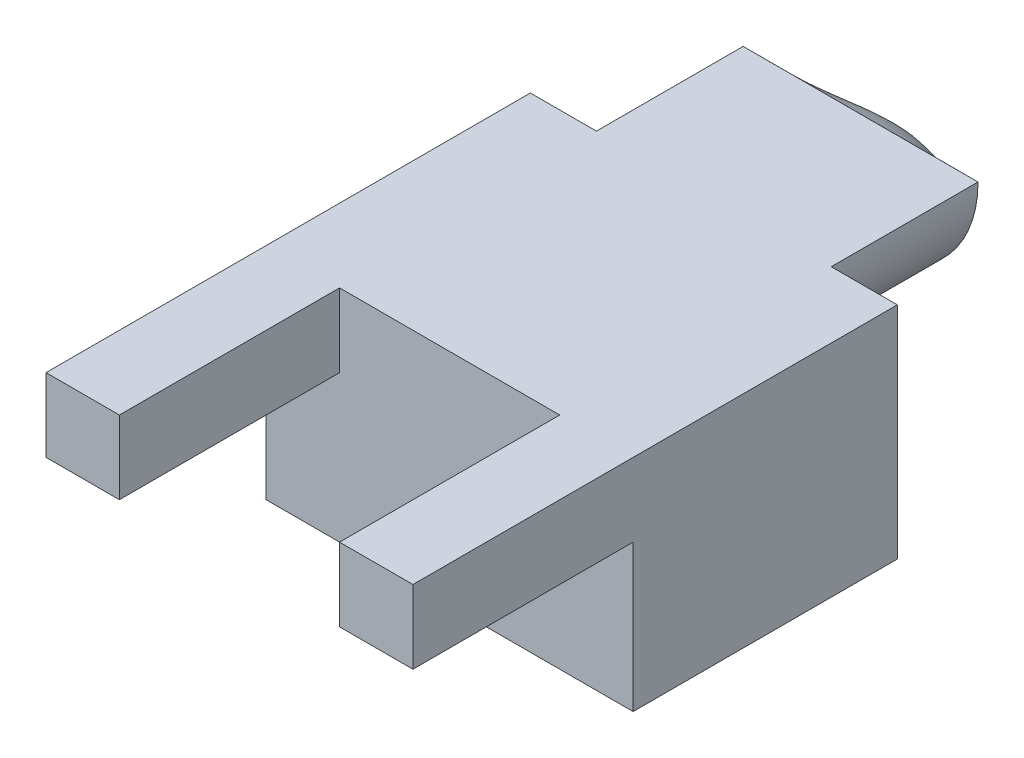
ISO-10303-21;
HEADER;
FILE_DESCRIPTION(('STEP AP214'),'2;1');
FILE_NAME('part.step','',(''),(''),'','','');
FILE_SCHEMA(('AUTOMOTIVE_DESIGN { 1 0 10303 214 1 1 1 1 }'));
ENDSEC;
DATA;
#1=APPLICATION_CONTEXT('core data for automotive mechanical design processes');
#2=APPLICATION_PROTOCOL_DEFINITION('international standard','automotive_design',2000,#1);
#3=PRODUCT_CONTEXT('',#1,'mechanical');
#4=PRODUCT('Part','Part','',(#3));
#5=PRODUCT_RELATED_PRODUCT_CATEGORY('part','',(#4));
#6=PRODUCT_DEFINITION_FORMATION('','',#4);
#7=PRODUCT_DEFINITION_CONTEXT('part definition',#1,'design');
#8=PRODUCT_DEFINITION('design','',#6,#7);
#9=PRODUCT_DEFINITION_SHAPE('','',#8);
#10=(LENGTH_UNIT() NAMED_UNIT(*) SI_UNIT(.MILLI.,.METRE.));
#11=(NAMED_UNIT(*) PLANE_ANGLE_UNIT() SI_UNIT($,.RADIAN.));
#12=(NAMED_UNIT(*) SI_UNIT($,.STERADIAN.) SOLID_ANGLE_UNIT());
#13=UNCERTAINTY_MEASURE_WITH_UNIT(LENGTH_MEASURE(1.E-05),#10,'distance_accuracy_value','');
#14=(GEOMETRIC_REPRESENTATION_CONTEXT(3) GLOBAL_UNCERTAINTY_ASSIGNED_CONTEXT((#13)) GLOBAL_UNIT_ASSIGNED_CONTEXT((#10,
#11,#12)) REPRESENTATION_CONTEXT('',''));
#15=CARTESIAN_POINT('',(0.,0.,0.));
#16=DIRECTION('',(0.,0.,1.));
#17=DIRECTION('',(1.,0.,0.));
#18=AXIS2_PLACEMENT_3D('',#15,#16,#17);
#19=CARTESIAN_POINT('',(0.,0.,0.));
#20=DIRECTION('',(0.,0.,-1.));
#21=DIRECTION('',(-1.,0.,0.));
#22=AXIS2_PLACEMENT_3D('',#19,#20,#21);
#23=PLANE('',#22);
#24=DIRECTION('',(0.,-1.,0.));
#25=VECTOR('',#24,1.);
#26=CARTESIAN_POINT('',(5.08,3.81,0.));
#27=LINE('',#26,#25);
#28=CARTESIAN_POINT('',(5.08,3.81,0.));
#29=VERTEX_POINT('',#28);
#30=CARTESIAN_POINT('',(5.08,2.54,0.));
#31=VERTEX_POINT('',#30);
#32=EDGE_CURVE('E182',#29,#31,#27,.T.);
#33=ORIENTED_EDGE('',*,*,#32,.F.);
#34=DIRECTION('',(-1.,0.,0.));
#35=VECTOR('',#34,1.);
#36=CARTESIAN_POINT('',(0.,3.81,0.));
#37=LINE('',#36,#35);
#38=CARTESIAN_POINT('',(1.27,3.81,0.));
#39=VERTEX_POINT('',#38);
#40=EDGE_CURVE('E184',#29,#39,#37,.T.);
#41=ORIENTED_EDGE('',*,*,#40,.T.);
#42=DIRECTION('',(0.,1.,0.));
#43=VECTOR('',#42,1.);
#44=CARTESIAN_POINT('',(1.27,3.81,0.));
#45=LINE('',#44,#43);
#46=CARTESIAN_POINT('',(1.27,2.54,0.));
#47=VERTEX_POINT('',#46);
#48=EDGE_CURVE('E212',#47,#39,#45,.T.);
#49=ORIENTED_EDGE('',*,*,#48,.F.);
#50=DIRECTION('',(1.,0.,0.));
#51=VECTOR('',#50,1.);
#52=CARTESIAN_POINT('',(0.,2.54,0.));
#53=LINE('',#52,#51);
#54=CARTESIAN_POINT('',(0.,2.54,0.));
#55=VERTEX_POINT('',#54);
#56=EDGE_CURVE('E208',#55,#47,#53,.T.);
#57=ORIENTED_EDGE('',*,*,#56,.F.);
#58=DIRECTION('',(0.,-1.,0.));
#59=VECTOR('',#58,1.);
#60=CARTESIAN_POINT('',(0.,0.,0.));
#61=LINE('',#60,#59);
#62=CARTESIAN_POINT('',(0.,0.,0.));
#63=VERTEX_POINT('',#62);
#64=EDGE_CURVE('E254',#55,#63,#61,.T.);
#65=ORIENTED_EDGE('',*,*,#64,.T.);
#66=DIRECTION('',(1.,0.,0.));
#67=VECTOR('',#66,1.);
#68=CARTESIAN_POINT('',(0.,0.,0.));
#69=LINE('',#68,#67);
#70=CARTESIAN_POINT('',(6.35,0.,0.));
#71=VERTEX_POINT('',#70);
#72=EDGE_CURVE('E256',#63,#71,#69,.T.);
#73=ORIENTED_EDGE('',*,*,#72,.T.);
#74=DIRECTION('',(0.,1.,0.));
#75=VECTOR('',#74,1.);
#76=CARTESIAN_POINT('',(6.35,0.,0.));
#77=LINE('',#76,#75);
#78=CARTESIAN_POINT('',(6.35,2.54,0.));
#79=VERTEX_POINT('',#78);
#80=EDGE_CURVE('E204',#71,#79,#77,.T.);
#81=ORIENTED_EDGE('',*,*,#80,.T.);
#82=DIRECTION('',(1.,0.,0.));
#83=VECTOR('',#82,1.);
#84=CARTESIAN_POINT('',(6.35,2.54,0.));
#85=LINE('',#84,#83);
#86=EDGE_CURVE('E187',#31,#79,#85,.T.);
#87=ORIENTED_EDGE('',*,*,#86,.F.);
#88=EDGE_LOOP('',(#33,#41,#49,#57,#65,#73,#81,#87));
#89=FACE_BOUND('',#88,.T.);
#90=ADVANCED_FACE('F83',(#89),#23,.F.);
#91=CARTESIAN_POINT('',(0.,0.,-4.572));
#92=DIRECTION('',(-1.,0.,0.));
#93=DIRECTION('',(0.,0.,1.));
#94=AXIS2_PLACEMENT_3D('',#91,#92,#93);
#95=PLANE('',#94);
#96=ORIENTED_EDGE('',*,*,#64,.F.);
#97=DIRECTION('',(0.,0.,-1.));
#98=VECTOR('',#97,1.);
#99=CARTESIAN_POINT('',(0.,2.54,3.81));
#100=LINE('',#99,#98);
#101=CARTESIAN_POINT('',(0.,2.54,3.81));
#102=VERTEX_POINT('',#101);
#103=EDGE_CURVE('E257',#102,#55,#100,.T.);
#104=ORIENTED_EDGE('',*,*,#103,.F.);
#105=DIRECTION('',(0.,-1.,0.));
#106=VECTOR('',#105,1.);
#107=CARTESIAN_POINT('',(0.,3.81,3.81));
#108=LINE('',#107,#106);
#109=CARTESIAN_POINT('',(0.,3.81,3.81));
#110=VERTEX_POINT('',#109);
#111=EDGE_CURVE('E218',#110,#102,#108,.T.);
#112=ORIENTED_EDGE('',*,*,#111,.F.);
#113=DIRECTION('',(0.,0.,1.));
#114=VECTOR('',#113,1.);
#115=CARTESIAN_POINT('',(0.,3.81,-4.572));
#116=LINE('',#115,#114);
#117=CARTESIAN_POINT('',(0.,3.81,-4.572));
#118=VERTEX_POINT('',#117);
#119=EDGE_CURVE('E13',#118,#110,#116,.T.);
#120=ORIENTED_EDGE('',*,*,#119,.F.);
#121=DIRECTION('',(0.,-1.,0.));
#122=VECTOR('',#121,1.);
#123=CARTESIAN_POINT('',(0.,0.,-4.572));
#124=LINE('',#123,#122);
#125=CARTESIAN_POINT('',(0.,0.,-4.572));
#126=VERTEX_POINT('',#125);
#127=EDGE_CURVE('E203',#118,#126,#124,.T.);
#128=ORIENTED_EDGE('',*,*,#127,.T.);
#129=DIRECTION('',(0.,0.,1.));
#130=VECTOR('',#129,1.);
#131=CARTESIAN_POINT('',(0.,0.,-4.572));
#132=LINE('',#131,#130);
#133=EDGE_CURVE('E251',#126,#63,#132,.T.);
#134=ORIENTED_EDGE('',*,*,#133,.T.);
#135=EDGE_LOOP('',(#96,#104,#112,#120,#128,#134));
#136=FACE_BOUND('',#135,.T.);
#137=ADVANCED_FACE('F329',(#136),#95,.T.);
#138=CARTESIAN_POINT('',(0.,3.81,-4.572));
#139=DIRECTION('',(0.,1.,0.));
#140=DIRECTION('',(0.,0.,1.));
#141=AXIS2_PLACEMENT_3D('',#138,#139,#140);
#142=PLANE('',#141);
#143=ORIENTED_EDGE('',*,*,#40,.F.);
#144=DIRECTION('',(0.,0.,-1.));
#145=VECTOR('',#144,1.);
#146=CARTESIAN_POINT('',(5.08,3.81,3.81));
#147=LINE('',#146,#145);
#148=CARTESIAN_POINT('',(5.08,3.81,3.81));
#149=VERTEX_POINT('',#148);
#150=EDGE_CURVE('E198',#149,#29,#147,.T.);
#151=ORIENTED_EDGE('',*,*,#150,.F.);
#152=DIRECTION('',(-1.,0.,0.));
#153=VECTOR('',#152,1.);
#154=CARTESIAN_POINT('',(6.35,3.81,3.81));
#155=LINE('',#154,#153);
#156=CARTESIAN_POINT('',(6.35,3.81,3.81));
#157=VERTEX_POINT('',#156);
#158=EDGE_CURVE('E280',#157,#149,#155,.T.);
#159=ORIENTED_EDGE('',*,*,#158,.F.);
#160=DIRECTION('',(0.,0.,1.));
#161=VECTOR('',#160,1.);
#162=CARTESIAN_POINT('',(6.35,3.81,-4.572));
#163=LINE('',#162,#161);
#164=CARTESIAN_POINT('',(6.35,3.81,-4.572));
#165=VERTEX_POINT('',#164);
#166=EDGE_CURVE('E100',#165,#157,#163,.T.);
#167=ORIENTED_EDGE('',*,*,#166,.F.);
#168=DIRECTION('',(-1.,0.,0.));
#169=VECTOR('',#168,1.);
#170=CARTESIAN_POINT('',(0.,3.81,-4.572));
#171=LINE('',#170,#169);
#172=CARTESIAN_POINT('',(5.207,3.81,-4.572));
#173=VERTEX_POINT('',#172);
#174=EDGE_CURVE('E241',#165,#173,#171,.T.);
#175=ORIENTED_EDGE('',*,*,#174,.T.);
#176=DIRECTION('',(0.,0.,1.));
#177=VECTOR('',#176,1.);
#178=CARTESIAN_POINT('',(5.207,3.81,-7.112));
#179=LINE('',#178,#177);
#180=CARTESIAN_POINT('',(5.20699972167354,3.81,-7.11143206771134));
#181=VERTEX_POINT('',#180);
#182=EDGE_CURVE('E290',#181,#173,#179,.T.);
#183=ORIENTED_EDGE('',*,*,#182,.F.);
#184=CARTESIAN_POINT('',(1.14300050463616,3.80999999999999,-7.11144132057572));
#185=CARTESIAN_POINT('',(1.2320306513021,3.81,-7.11186431632875));
#186=CARTESIAN_POINT('',(1.32106113587505,3.81,-7.11205391509631));
#187=CARTESIAN_POINT('',(1.49912232090601,3.81,-7.11220393854591));
#188=CARTESIAN_POINT('',(1.58815302136378,3.81,-7.11216436343169));
#189=CARTESIAN_POINT('',(1.76621429760909,3.81,-7.1120936589257));
#190=CARTESIAN_POINT('',(1.85524487339669,3.81,-7.11206252953025));
#191=CARTESIAN_POINT('',(2.0333060686502,3.81,-7.11204854654176));
#192=CARTESIAN_POINT('',(2.12233668811612,3.81,-7.11206569295735));
#193=CARTESIAN_POINT('',(2.36982375119607,3.81,-7.11212380894754));
#194=CARTESIAN_POINT('',(2.52828018538376,3.81,-7.11217292929915));
#195=CARTESIAN_POINT('',(2.84519305758697,3.81,-7.11223651561029));
#196=CARTESIAN_POINT('',(3.00364949560249,3.81,-7.11225098157197));
#197=CARTESIAN_POINT('',(3.32056236841674,3.81,-7.11224750999009));
#198=CARTESIAN_POINT('',(3.47901880321548,3.81,-7.11222957244675));
#199=CARTESIAN_POINT('',(3.79593167834449,3.81,-7.11217743236209));
#200=CARTESIAN_POINT('',(3.95438811867475,3.81000000000001,-7.11214322981965));
#201=CARTESIAN_POINT('',(4.20402417912265,3.81000000000001,-7.11207455399221));
#202=CARTESIAN_POINT('',(4.29520379756178,3.81,-7.11204636117595));
#203=CARTESIAN_POINT('',(4.477563016709,3.81,-7.11204862306896));
#204=CARTESIAN_POINT('',(4.5687426174171,3.81,-7.11207907776872));
#205=CARTESIAN_POINT('',(4.75110187243864,3.81,-7.11215472487758));
#206=CARTESIAN_POINT('',(4.84228152675207,3.81,-7.11219991729496));
#207=CARTESIAN_POINT('',(4.97905102198201,3.81,-7.11211361150889));
#208=CARTESIAN_POINT('',(5.02464085972267,3.81,-7.11205916050082));
#209=CARTESIAN_POINT('',(5.11582037390659,3.81,-7.11184151422171));
#210=CARTESIAN_POINT('',(5.16141005034909,3.81,-7.11167831866184));
#211=CARTESIAN_POINT('',(5.20699944334705,3.81,-7.11143206102018));
#212=B_SPLINE_CURVE_WITH_KNOTS('',3,(#184,#185,#186,#187,#188,#189,#190,#191,#192,#193,#194,
#195,#196,#197,#198,#199,#200,#201,#202,#203,#204,#205,#206,#207,#208,#209,#210,#211),
.UNSPECIFIED.,.F.,.F.,(4,2,2,2,2,2,2,2,2,2,2,2,2,4),(0.,0.2670921484212,0.534184059403624,
0.801275853628482,1.0683676956029,1.54373703347932,2.01910634166462,2.4944756467027,
2.96984498419257,3.24338384217931,3.51692265579364,3.79046162294121,3.92723112873933,
4.06400099779846),.UNSPECIFIED.);
#213=CARTESIAN_POINT('',(1.14300025231807,3.81,-7.11144132692253));
#214=VERTEX_POINT('',#213);
#215=EDGE_CURVE('E90',#214,#181,#212,.T.);
#216=ORIENTED_EDGE('',*,*,#215,.F.);
#217=DIRECTION('',(0.,0.,1.));
#218=VECTOR('',#217,1.);
#219=CARTESIAN_POINT('',(1.143,3.81,-7.112));
#220=LINE('',#219,#218);
#221=CARTESIAN_POINT('',(1.143,3.81,-4.572));
#222=VERTEX_POINT('',#221);
#223=EDGE_CURVE('E192',#214,#222,#220,.T.);
#224=ORIENTED_EDGE('',*,*,#223,.T.);
#225=EDGE_CURVE('E127',#222,#118,#171,.T.);
#226=ORIENTED_EDGE('',*,*,#225,.T.);
#227=ORIENTED_EDGE('',*,*,#119,.T.);
#228=DIRECTION('',(-1.,0.,0.));
#229=VECTOR('',#228,1.);
#230=CARTESIAN_POINT('',(0.,3.81,3.81));
#231=LINE('',#230,#229);
#232=CARTESIAN_POINT('',(1.27,3.81,3.81));
#233=VERTEX_POINT('',#232);
#234=EDGE_CURVE('E225',#233,#110,#231,.T.);
#235=ORIENTED_EDGE('',*,*,#234,.F.);
#236=DIRECTION('',(0.,0.,-1.));
#237=VECTOR('',#236,1.);
#238=CARTESIAN_POINT('',(1.27,3.81,3.81));
#239=LINE('',#238,#237);
#240=EDGE_CURVE('E202',#233,#39,#239,.T.);
#241=ORIENTED_EDGE('',*,*,#240,.T.);
#242=EDGE_LOOP('',(#143,#151,#159,#167,#175,#183,#216,#224,#226,#227,#235,#241));
#243=FACE_BOUND('',#242,.T.);
#244=ADVANCED_FACE('F196',(#243),#142,.T.);
#245=CARTESIAN_POINT('',(6.35,0.,-4.572));
#246=DIRECTION('',(1.,0.,0.));
#247=DIRECTION('',(0.,0.,-1.));
#248=AXIS2_PLACEMENT_3D('',#245,#246,#247);
#249=PLANE('',#248);
#250=ORIENTED_EDGE('',*,*,#80,.F.);
#251=DIRECTION('',(0.,0.,1.));
#252=VECTOR('',#251,1.);
#253=CARTESIAN_POINT('',(6.35,0.,-4.572));
#254=LINE('',#253,#252);
#255=CARTESIAN_POINT('',(6.35,0.,-4.572));
#256=VERTEX_POINT('',#255);
#257=EDGE_CURVE('E249',#256,#71,#254,.T.);
#258=ORIENTED_EDGE('',*,*,#257,.F.);
#259=DIRECTION('',(0.,1.,0.));
#260=VECTOR('',#259,1.);
#261=CARTESIAN_POINT('',(6.35,0.,-4.572));
#262=LINE('',#261,#260);
#263=EDGE_CURVE('E355',#256,#165,#262,.T.);
#264=ORIENTED_EDGE('',*,*,#263,.T.);
#265=ORIENTED_EDGE('',*,*,#166,.T.);
#266=DIRECTION('',(0.,1.,0.));
#267=VECTOR('',#266,1.);
#268=CARTESIAN_POINT('',(6.35,3.81,3.81));
#269=LINE('',#268,#267);
#270=CARTESIAN_POINT('',(6.35,2.54,3.81));
#271=VERTEX_POINT('',#270);
#272=EDGE_CURVE('E272',#271,#157,#269,.T.);
#273=ORIENTED_EDGE('',*,*,#272,.F.);
#274=DIRECTION('',(0.,0.,-1.));
#275=VECTOR('',#274,1.);
#276=CARTESIAN_POINT('',(6.35,2.54,3.81));
#277=LINE('',#276,#275);
#278=EDGE_CURVE('E214',#271,#79,#277,.T.);
#279=ORIENTED_EDGE('',*,*,#278,.T.);
#280=EDGE_LOOP('',(#250,#258,#264,#265,#273,#279));
#281=FACE_BOUND('',#280,.T.);
#282=ADVANCED_FACE('F274',(#281),#249,.T.);
#283=CARTESIAN_POINT('',(0.,0.,-4.572));
#284=DIRECTION('',(0.,-1.,0.));
#285=DIRECTION('',(0.,0.,-1.));
#286=AXIS2_PLACEMENT_3D('',#283,#284,#285);
#287=PLANE('',#286);
#288=ORIENTED_EDGE('',*,*,#72,.F.);
#289=ORIENTED_EDGE('',*,*,#133,.F.);
#290=DIRECTION('',(1.,0.,0.));
#291=VECTOR('',#290,1.);
#292=CARTESIAN_POINT('',(0.,0.,-4.572));
#293=LINE('',#292,#291);
#294=EDGE_CURVE('E354',#126,#256,#293,.T.);
#295=ORIENTED_EDGE('',*,*,#294,.T.);
#296=ORIENTED_EDGE('',*,*,#257,.T.);
#297=EDGE_LOOP('',(#288,#289,#295,#296));
#298=FACE_BOUND('',#297,.T.);
#299=ADVANCED_FACE('F327',(#298),#287,.T.);
#300=CARTESIAN_POINT('',(0.,0.,-4.572));
#301=DIRECTION('',(0.,0.,-1.));
#302=DIRECTION('',(-1.,0.,0.));
#303=AXIS2_PLACEMENT_3D('',#300,#301,#302);
#304=PLANE('',#303);
#305=CARTESIAN_POINT('',(3.175,3.81,-4.572));
#306=DIRECTION('',(0.,0.,-1.));
#307=DIRECTION('',(-1.,0.,0.));
#308=AXIS2_PLACEMENT_3D('',#305,#306,#307);
#309=CIRCLE('',#308,2.032);
#310=EDGE_CURVE('E109',#173,#222,#309,.T.);
#311=ORIENTED_EDGE('',*,*,#310,.F.);
#312=ORIENTED_EDGE('',*,*,#174,.F.);
#313=ORIENTED_EDGE('',*,*,#263,.F.);
#314=ORIENTED_EDGE('',*,*,#294,.F.);
#315=ORIENTED_EDGE('',*,*,#127,.F.);
#316=ORIENTED_EDGE('',*,*,#225,.F.);
#317=EDGE_LOOP('',(#311,#312,#313,#314,#315,#316));
#318=FACE_BOUND('',#317,.T.);
#319=ADVANCED_FACE('F323',(#318),#304,.T.);
#320=CARTESIAN_POINT('',(0.,2.54,3.81));
#321=DIRECTION('',(0.,1.,0.));
#322=DIRECTION('',(0.,0.,1.));
#323=AXIS2_PLACEMENT_3D('',#320,#321,#322);
#324=PLANE('',#323);
#325=ORIENTED_EDGE('',*,*,#56,.T.);
#326=DIRECTION('',(0.,0.,-1.));
#327=VECTOR('',#326,1.);
#328=CARTESIAN_POINT('',(1.27,2.54,3.81));
#329=LINE('',#328,#327);
#330=CARTESIAN_POINT('',(1.27,2.54,3.81));
#331=VERTEX_POINT('',#330);
#332=EDGE_CURVE('E230',#331,#47,#329,.T.);
#333=ORIENTED_EDGE('',*,*,#332,.F.);
#334=DIRECTION('',(1.,0.,0.));
#335=VECTOR('',#334,1.);
#336=CARTESIAN_POINT('',(0.,2.54,3.81));
#337=LINE('',#336,#335);
#338=EDGE_CURVE('E221',#102,#331,#337,.T.);
#339=ORIENTED_EDGE('',*,*,#338,.F.);
#340=ORIENTED_EDGE('',*,*,#103,.T.);
#341=EDGE_LOOP('',(#325,#333,#339,#340));
#342=FACE_BOUND('',#341,.T.);
#343=ADVANCED_FACE('F319',(#342),#324,.F.);
#344=CARTESIAN_POINT('',(1.27,3.81,3.81));
#345=DIRECTION('',(-1.,0.,0.));
#346=DIRECTION('',(0.,0.,1.));
#347=AXIS2_PLACEMENT_3D('',#344,#345,#346);
#348=PLANE('',#347);
#349=ORIENTED_EDGE('',*,*,#48,.T.);
#350=ORIENTED_EDGE('',*,*,#240,.F.);
#351=DIRECTION('',(0.,1.,0.));
#352=VECTOR('',#351,1.);
#353=CARTESIAN_POINT('',(1.27,3.81,3.81));
#354=LINE('',#353,#352);
#355=EDGE_CURVE('E223',#331,#233,#354,.T.);
#356=ORIENTED_EDGE('',*,*,#355,.F.);
#357=ORIENTED_EDGE('',*,*,#332,.T.);
#358=EDGE_LOOP('',(#349,#350,#356,#357));
#359=FACE_BOUND('',#358,.T.);
#360=ADVANCED_FACE('F315',(#359),#348,.F.);
#361=CARTESIAN_POINT('',(0.,0.,3.81));
#362=DIRECTION('',(0.,0.,1.));
#363=DIRECTION('',(1.,0.,0.));
#364=AXIS2_PLACEMENT_3D('',#361,#362,#363);
#365=PLANE('',#364);
#366=ORIENTED_EDGE('',*,*,#111,.T.);
#367=ORIENTED_EDGE('',*,*,#338,.T.);
#368=ORIENTED_EDGE('',*,*,#355,.T.);
#369=ORIENTED_EDGE('',*,*,#234,.T.);
#370=EDGE_LOOP('',(#366,#367,#368,#369));
#371=FACE_BOUND('',#370,.T.);
#372=ADVANCED_FACE('F312',(#371),#365,.T.);
#373=CARTESIAN_POINT('',(5.08,3.81,3.81));
#374=DIRECTION('',(1.,0.,0.));
#375=DIRECTION('',(0.,0.,-1.));
#376=AXIS2_PLACEMENT_3D('',#373,#374,#375);
#377=PLANE('',#376);
#378=ORIENTED_EDGE('',*,*,#32,.T.);
#379=DIRECTION('',(0.,0.,-1.));
#380=VECTOR('',#379,1.);
#381=CARTESIAN_POINT('',(5.08,2.54,3.81));
#382=LINE('',#381,#380);
#383=CARTESIAN_POINT('',(5.08,2.54,3.81));
#384=VERTEX_POINT('',#383);
#385=EDGE_CURVE('E209',#384,#31,#382,.T.);
#386=ORIENTED_EDGE('',*,*,#385,.F.);
#387=DIRECTION('',(0.,-1.,0.));
#388=VECTOR('',#387,1.);
#389=CARTESIAN_POINT('',(5.08,3.81,3.81));
#390=LINE('',#389,#388);
#391=EDGE_CURVE('E207',#149,#384,#390,.T.);
#392=ORIENTED_EDGE('',*,*,#391,.F.);
#393=ORIENTED_EDGE('',*,*,#150,.T.);
#394=EDGE_LOOP('',(#378,#386,#392,#393));
#395=FACE_BOUND('',#394,.T.);
#396=ADVANCED_FACE('F206',(#395),#377,.F.);
#397=CARTESIAN_POINT('',(6.35,2.54,3.81));
#398=DIRECTION('',(0.,1.,0.));
#399=DIRECTION('',(0.,0.,1.));
#400=AXIS2_PLACEMENT_3D('',#397,#398,#399);
#401=PLANE('',#400);
#402=ORIENTED_EDGE('',*,*,#86,.T.);
#403=ORIENTED_EDGE('',*,*,#278,.F.);
#404=DIRECTION('',(1.,0.,0.));
#405=VECTOR('',#404,1.);
#406=CARTESIAN_POINT('',(6.35,2.54,3.81));
#407=LINE('',#406,#405);
#408=EDGE_CURVE('E276',#384,#271,#407,.T.);
#409=ORIENTED_EDGE('',*,*,#408,.F.);
#410=ORIENTED_EDGE('',*,*,#385,.T.);
#411=EDGE_LOOP('',(#402,#403,#409,#410));
#412=FACE_BOUND('',#411,.T.);
#413=ADVANCED_FACE('F269',(#412),#401,.F.);
#414=CARTESIAN_POINT('',(0.,0.,3.81));
#415=DIRECTION('',(0.,0.,-1.));
#416=DIRECTION('',(-1.,0.,0.));
#417=AXIS2_PLACEMENT_3D('',#414,#415,#416);
#418=PLANE('',#417);
#419=ORIENTED_EDGE('',*,*,#272,.T.);
#420=ORIENTED_EDGE('',*,*,#158,.T.);
#421=ORIENTED_EDGE('',*,*,#391,.T.);
#422=ORIENTED_EDGE('',*,*,#408,.T.);
#423=EDGE_LOOP('',(#419,#420,#421,#422));
#424=FACE_BOUND('',#423,.T.);
#425=ADVANCED_FACE('F303',(#424),#418,.F.);
#426=CARTESIAN_POINT('',(3.175,3.81,-7.112));
#427=DIRECTION('',(0.,0.,1.));
#428=DIRECTION('',(1.,0.,0.));
#429=AXIS2_PLACEMENT_3D('',#426,#427,#428);
#430=CYLINDRICAL_SURFACE('',#429,2.032);
#431=ORIENTED_EDGE('',*,*,#310,.T.);
#432=ORIENTED_EDGE('',*,*,#223,.F.);
#433=CARTESIAN_POINT('',(5.20699999999959,3.80999870639031,-7.11143207440249));
#434=CARTESIAN_POINT('',(5.20700609218454,3.75297261581681,-7.11214018080479));
#435=CARTESIAN_POINT('',(5.20459959567213,3.69594634060995,-7.11240646683885));
#436=CARTESIAN_POINT('',(5.19500534012542,3.58229955960586,-7.11249901185386));
#437=CARTESIAN_POINT('',(5.18781784779889,3.52567903135211,-7.11232529537882));
#438=CARTESIAN_POINT('',(5.16871218657773,3.413282729702,-7.11198154926665));
#439=CARTESIAN_POINT('',(5.15679732813187,3.3575063934555,-7.11181151713717));
#440=CARTESIAN_POINT('',(5.12832401707744,3.24715327026452,-7.11163277673893));
#441=CARTESIAN_POINT('',(5.11176562200182,3.19257646846695,-7.1116240664715));
#442=CARTESIAN_POINT('',(5.07409572598318,3.08493937153186,-7.11172453908797));
#443=CARTESIAN_POINT('',(5.0529787562437,3.03188098534956,-7.1118338642116));
#444=CARTESIAN_POINT('',(5.00636599498302,2.92774028777348,-7.11205898829811));
#445=CARTESIAN_POINT('',(4.98087015230145,2.8766579994759,-7.11217478733662));
#446=CARTESIAN_POINT('',(4.89807304647504,2.72694119686144,-7.11240387808512));
#447=CARTESIAN_POINT('',(4.8344208351542,2.63171888641979,-7.11239936913123));
#448=CARTESIAN_POINT('',(4.6919860254199,2.45321986465185,-7.11233388451106));
#449=CARTESIAN_POINT('',(4.613182273222,2.36996014221509,-7.11227282943775));
#450=CARTESIAN_POINT('',(4.44269454318136,2.21782504807519,-7.11223278763642));
#451=CARTESIAN_POINT('',(4.35100858994294,2.14895188648616,-7.1122538135082));
#452=CARTESIAN_POINT('',(4.15737987046149,2.02758252579116,-7.11214048317339));
#453=CARTESIAN_POINT('',(4.05543740219715,1.97508585108684,-7.11200613147974));
#454=CARTESIAN_POINT('',(3.84419165763254,1.8879545035212,-7.11187299815306));
#455=CARTESIAN_POINT('',(3.73488883820931,1.8533187231389,-7.11187420811309));
#456=CARTESIAN_POINT('',(3.51201891468404,1.80288858767983,-7.11197902908213));
#457=CARTESIAN_POINT('',(3.39845176794333,1.78709442105068,-7.11208264111531));
#458=CARTESIAN_POINT('',(3.1702746953132,1.77479583002928,-7.11215627706426));
#459=CARTESIAN_POINT('',(3.05566474198257,1.77829191472993,-7.1121262974544));
#460=CARTESIAN_POINT('',(2.82865623605838,1.80447647827728,-7.11198993505582));
#461=CARTESIAN_POINT('',(2.7162577258551,1.82716532465643,-7.111883550804));
#462=CARTESIAN_POINT('',(2.49687250378136,1.8910885117441,-7.11186217052689));
#463=CARTESIAN_POINT('',(2.38988546546459,1.93232173227789,-7.11194716294273));
#464=CARTESIAN_POINT('',(2.18436300456338,2.0321615457296,-7.1121177321666));
#465=CARTESIAN_POINT('',(2.08582651542387,2.09076594203536,-7.11220330889941));
#466=CARTESIAN_POINT('',(1.89996805933838,2.22368891175596,-7.11226921520168));
#467=CARTESIAN_POINT('',(1.81264954297182,2.29801230172238,-7.11224951246683));
#468=CARTESIAN_POINT('',(1.65165843728695,2.46036620869364,-7.11231963034099));
#469=CARTESIAN_POINT('',(1.57799339067226,2.54840425307171,-7.11240951128172));
#470=CARTESIAN_POINT('',(1.47946579992113,2.6886332354376,-7.11240016565748));
#471=CARTESIAN_POINT('',(1.44862227021757,2.73672981209927,-7.11237303858029));
#472=CARTESIAN_POINT('',(1.39109409256484,2.83534323838653,-7.11224474026992));
#473=CARTESIAN_POINT('',(1.36440793110364,2.88585919842486,-7.11214359605983));
#474=CARTESIAN_POINT('',(1.31570598537074,2.98827922695132,-7.1119214999634));
#475=CARTESIAN_POINT('',(1.2936336848116,3.04015650089375,-7.11180082442853));
#476=CARTESIAN_POINT('',(1.25388931832191,3.14552669587394,-7.11164702377869));
#477=CARTESIAN_POINT('',(1.23621374551288,3.19901829087459,-7.11161382868427));
#478=CARTESIAN_POINT('',(1.2079312769317,3.29827060364938,-7.111698680228));
#479=CARTESIAN_POINT('',(1.19663763830839,3.34383717906584,-7.11179248726518));
#480=CARTESIAN_POINT('',(1.17722826211727,3.43565486602511,-7.11204754228774));
#481=CARTESIAN_POINT('',(1.16911327152963,3.48190613582371,-7.11220880610702));
#482=CARTESIAN_POINT('',(1.15608301395966,3.57502097288197,-7.11244380150206));
#483=CARTESIAN_POINT('',(1.15117893658757,3.62188610690947,-7.11251722770256));
#484=CARTESIAN_POINT('',(1.14463629799359,3.71583409078585,-7.11231055037837));
#485=CARTESIAN_POINT('',(1.14299714665513,3.76291689974899,-7.11203051075556));
#486=CARTESIAN_POINT('',(1.14300000000037,3.80999877963289,-7.11144133326933));
#487=B_SPLINE_CURVE_WITH_KNOTS('',3,(#433,#434,#435,#436,#437,#438,#439,#440,#441,#442,#443,
#444,#445,#446,#447,#448,#449,#450,#451,#452,#453,#454,#455,#456,#457,#458,#459,#460,#461,#462,
#463,#464,#465,#466,#467,#468,#469,#470,#471,#472,#473,#474,#475,#476,#477,#478,#479,#480,#481,
#482,#483,#484,#485,#486),.UNSPECIFIED.,.F.,.F.,(4,2,2,2,2,2,2,2,2,2,2,2,2,2,2,2,2,2,2,2,2,2,2,
2,2,2,4),(0.,0.171031908920318,0.342054277627751,0.512957094699288,0.683857794395572,
0.854964669781089,1.02607354442249,1.36792127681508,1.71024979093757,2.05263085615692,
2.395001977178,2.73735186584615,3.0797051785563,3.42206752642454,3.76443643052069,
4.10678465656684,4.4490896106025,4.79149960471999,5.1340981991654,5.30534234848731,
5.47652400904104,5.64546689819094,5.81427460140538,5.95500219781192,6.09576284529759,
6.23701145053043,6.37823452357402),.UNSPECIFIED.);
#488=EDGE_CURVE('E287',#181,#214,#487,.T.);
#489=ORIENTED_EDGE('',*,*,#488,.F.);
#490=ORIENTED_EDGE('',*,*,#182,.T.);
#491=EDGE_LOOP('',(#431,#432,#489,#490));
#492=FACE_BOUND('',#491,.T.);
#493=ADVANCED_FACE('F299',(#492),#430,.T.);
#494=CARTESIAN_POINT('',(1.0637172173097,1.66647125789438,-6.59161236392292));
#495=CARTESIAN_POINT('',(1.0637172173097,2.09942161768614,-6.60457527060517));
#496=CARTESIAN_POINT('',(1.0637172173097,2.5323719774779,-6.76930453950361));
#497=CARTESIAN_POINT('',(1.0637172173097,2.96532233726966,-7.04262303525734));
#498=CARTESIAN_POINT('',(1.0637172173097,3.39827269706143,-7.07770469585397));
#499=CARTESIAN_POINT('',(1.0637172173097,3.83122305685319,-7.11265595126352));
#500=CARTESIAN_POINT('',(1.40019956883645,1.66647125789438,-6.70459370468936));
#501=CARTESIAN_POINT('',(1.40019956883645,2.09942161768614,-6.76921761590891));
#502=CARTESIAN_POINT('',(1.40019956883645,2.5323719774779,-6.96956276769823));
#503=CARTESIAN_POINT('',(1.40019956883645,2.96532233726966,-7.32561862798199));
#504=CARTESIAN_POINT('',(1.40019956883645,3.39827269706143,-7.2453996203542));
#505=CARTESIAN_POINT('',(1.40019956883645,3.83122305685319,-7.10674258791722));
#506=CARTESIAN_POINT('',(1.73668192036321,1.66647125789438,-6.80914419894035));
#507=CARTESIAN_POINT('',(1.73668192036321,2.09942161768614,-6.92218791020794));
#508=CARTESIAN_POINT('',(1.73668192036321,2.5323719774779,-7.17673667348901));
#509=CARTESIAN_POINT('',(1.73668192036321,2.96532233726966,-7.59085113963383));
#510=CARTESIAN_POINT('',(1.73668192036321,3.39827269706143,-7.4180243263893));
#511=CARTESIAN_POINT('',(1.73668192036321,3.83122305685319,-7.09562276575328));
#512=CARTESIAN_POINT('',(2.07316427188996,1.66647125789438,-6.907062859214));
#513=CARTESIAN_POINT('',(2.07316427188996,2.09942161768614,-7.07021209442379));
#514=CARTESIAN_POINT('',(2.07316427188996,2.5323719774779,-7.40178510717043));
#515=CARTESIAN_POINT('',(2.07316427188996,2.96532233726966,-7.8607895492002));
#516=CARTESIAN_POINT('',(2.07316427188996,3.39827269706143,-7.58065379507531));
#517=CARTESIAN_POINT('',(2.07316427188996,3.83122305685319,-7.08824436547702));
#518=CARTESIAN_POINT('',(2.57788779918009,1.66647125789438,-7.01869684414391));
#519=CARTESIAN_POINT('',(2.57788779918009,2.09942161768614,-7.24103163961338));
#520=CARTESIAN_POINT('',(2.57788779918009,2.5323719774779,-7.66692935602618));
#521=CARTESIAN_POINT('',(2.57788779918009,2.96532233726966,-8.23622382597383));
#522=CARTESIAN_POINT('',(2.57788779918009,3.39827269706143,-7.76943952981336));
#523=CARTESIAN_POINT('',(2.57788779918009,3.83122305685319,-7.07852760514965));
#524=CARTESIAN_POINT('',(3.08261132647023,1.66647125789438,-7.050422896292));
#525=CARTESIAN_POINT('',(3.08261132647023,2.09942161768614,-7.29006032226877));
#526=CARTESIAN_POINT('',(3.08261132647023,2.5323719774779,-7.73913243051969));
#527=CARTESIAN_POINT('',(3.08261132647023,2.96532233726966,-8.371429826241));
#528=CARTESIAN_POINT('',(3.08261132647023,3.39827269706143,-7.82012438092504));
#529=CARTESIAN_POINT('',(3.08261132647023,3.83122305685319,-7.07597624192135));
#530=CARTESIAN_POINT('',(3.2508525022336,1.66647125789438,-7.05080112315829));
#531=CARTESIAN_POINT('',(3.2508525022336,2.09942161768614,-7.29086075054367));
#532=CARTESIAN_POINT('',(3.2508525022336,2.5323719774779,-7.74033629454797));
#533=CARTESIAN_POINT('',(3.2508525022336,2.96532233726966,-8.37417283553059));
#534=CARTESIAN_POINT('',(3.2508525022336,3.39827269706143,-7.82111967940529));
#535=CARTESIAN_POINT('',(3.2508525022336,3.83122305685319,-7.07593501907132));
#536=CARTESIAN_POINT('',(3.75290745922681,1.66647125789438,-7.02129739149245));
#537=CARTESIAN_POINT('',(3.75290745922681,2.09942161768614,-7.24634211915924));
#538=CARTESIAN_POINT('',(3.75290745922681,2.5323719774779,-7.67670335892532));
#539=CARTESIAN_POINT('',(3.75290745922681,2.96532233726966,-8.25202800374903));
#540=CARTESIAN_POINT('',(3.75290745922681,3.39827269706143,-7.77746584484934));
#541=CARTESIAN_POINT('',(3.75290745922681,3.83122305685319,-7.07806764549896));
#542=CARTESIAN_POINT('',(4.25496241622001,1.66647125789438,-6.91090772769681));
#543=CARTESIAN_POINT('',(4.25496241622001,2.09942161768614,-7.07925623763747));
#544=CARTESIAN_POINT('',(4.25496241622001,2.5323719774779,-7.41887095380419));
#545=CARTESIAN_POINT('',(4.25496241622001,2.96532233726966,-7.885625241302));
#546=CARTESIAN_POINT('',(4.25496241622001,3.39827269706143,-7.59479440607275));
#547=CARTESIAN_POINT('',(4.25496241622001,3.83122305685319,-7.08762667389638));
#548=CARTESIAN_POINT('',(4.58877619744984,1.66647125789438,-6.81253902261977));
#549=CARTESIAN_POINT('',(4.58877619744984,2.09942161768614,-6.93186183841131));
#550=CARTESIAN_POINT('',(4.58877619744984,2.5323719774779,-7.19570316955876));
#551=CARTESIAN_POINT('',(4.58877619744984,2.96532233726966,-7.61712609855732));
#552=CARTESIAN_POINT('',(4.58877619744984,3.39827269706143,-7.43608079102733));
#553=CARTESIAN_POINT('',(4.58877619744984,3.83122305685319,-7.09454843781371));
#554=CARTESIAN_POINT('',(4.92258997867966,1.66647125789438,-6.70514979493756));
#555=CARTESIAN_POINT('',(4.92258997867966,2.09942161768614,-6.77680825872938));
#556=CARTESIAN_POINT('',(4.92258997867966,2.5323719774779,-6.9863157192788));
#557=CARTESIAN_POINT('',(4.92258997867966,2.96532233726966,-7.35136900002145));
#558=CARTESIAN_POINT('',(4.92258997867966,3.39827269706143,-7.26364736337877));
#559=CARTESIAN_POINT('',(4.92258997867966,3.83122305685319,-7.10579222450027));
#560=CARTESIAN_POINT('',(5.25640375990949,1.66647125789438,-6.58687020164295));
#561=CARTESIAN_POINT('',(5.25640375990949,2.09942161768614,-6.60754067640726));
#562=CARTESIAN_POINT('',(5.25640375990949,2.5323719774779,-6.7805149211679));
#563=CARTESIAN_POINT('',(5.25640375990949,2.96532233726966,-7.06668045112731));
#564=CARTESIAN_POINT('',(5.25640375990949,3.39827269706143,-7.09197153063743));
#565=CARTESIAN_POINT('',(5.25640375990949,3.83122305685319,-7.11212045233288));
#566=B_SPLINE_SURFACE_WITH_KNOTS('',5,5,((#494,#495,#496,#497,#498,#499),(#500,#501,#502,#503,
#504,#505),(#506,#507,#508,#509,#510,#511),(#512,#513,#514,#515,#516,#517),(#518,#519,#520,#521,
#522,#523),(#524,#525,#526,#527,#528,#529),(#530,#531,#532,#533,#534,#535),(#536,#537,#538,#539,
#540,#541),(#542,#543,#544,#545,#546,#547),(#548,#549,#550,#551,#552,#553),(#554,#555,#556,#557,
#558,#559),(#560,#561,#562,#563,#564,#565)),.UNSPECIFIED.,.F.,.F.,.F.,(6,3,3,6),(6,6),
(-2.1112827826903,-0.428871025056528,0.412334853760358,2.08140375990949),(-1.49276382073291,
0.671987978225905),.UNSPECIFIED.);
#567=ORIENTED_EDGE('',*,*,#215,.T.);
#568=ORIENTED_EDGE('',*,*,#488,.T.);
#569=EDGE_LOOP('',(#567,#568));
#570=FACE_BOUND('',#569,.T.);
#571=ADVANCED_FACE('F85',(#570),#566,.F.);
#572=CLOSED_SHELL('',(#90,#137,#244,#282,#299,#319,#343,#360,#372,#396,#413,#425,#493,#571));
#573=MANIFOLD_SOLID_BREP('B2',#572);
#574=ADVANCED_BREP_SHAPE_REPRESENTATION('',(#18,#573),#14);
#575=SHAPE_DEFINITION_REPRESENTATION(#9,#574);
ENDSEC;
END-ISO-10303-21;
